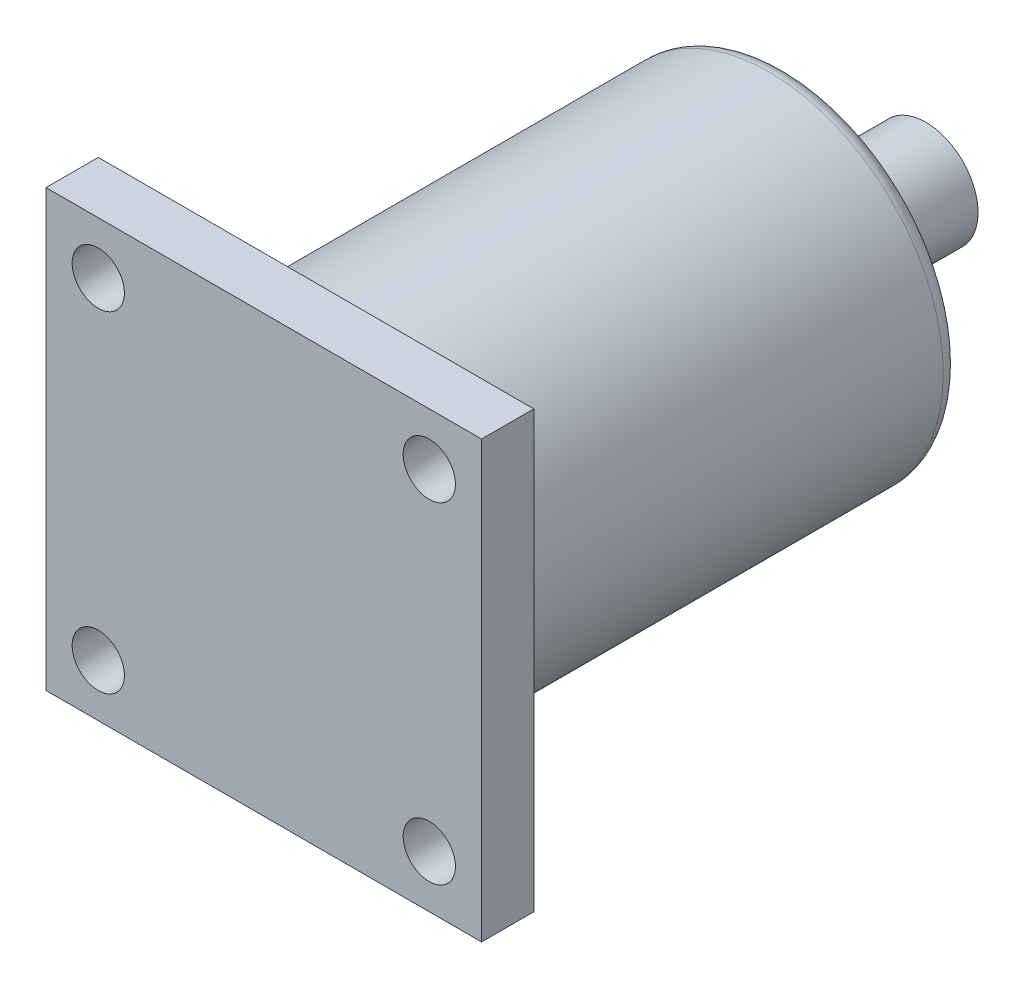
ISO-10303-21;
HEADER;
FILE_DESCRIPTION(('STEP AP214'),'2;1');
FILE_NAME('part.step','',(''),(''),'','','');
FILE_SCHEMA(('AUTOMOTIVE_DESIGN { 1 0 10303 214 1 1 1 1 }'));
ENDSEC;
DATA;
#1=APPLICATION_CONTEXT('core data for automotive mechanical design processes');
#2=APPLICATION_PROTOCOL_DEFINITION('international standard','automotive_design',2000,#1);
#3=PRODUCT_CONTEXT('',#1,'mechanical');
#4=PRODUCT('Part','Part','',(#3));
#5=PRODUCT_RELATED_PRODUCT_CATEGORY('part','',(#4));
#6=PRODUCT_DEFINITION_FORMATION('','',#4);
#7=PRODUCT_DEFINITION_CONTEXT('part definition',#1,'design');
#8=PRODUCT_DEFINITION('design','',#6,#7);
#9=PRODUCT_DEFINITION_SHAPE('','',#8);
#10=(LENGTH_UNIT() NAMED_UNIT(*) SI_UNIT(.MILLI.,.METRE.));
#11=(NAMED_UNIT(*) PLANE_ANGLE_UNIT() SI_UNIT($,.RADIAN.));
#12=(NAMED_UNIT(*) SI_UNIT($,.STERADIAN.) SOLID_ANGLE_UNIT());
#13=UNCERTAINTY_MEASURE_WITH_UNIT(LENGTH_MEASURE(1.E-05),#10,'distance_accuracy_value','');
#14=(GEOMETRIC_REPRESENTATION_CONTEXT(3) GLOBAL_UNCERTAINTY_ASSIGNED_CONTEXT((#13)) GLOBAL_UNIT_ASSIGNED_CONTEXT((#10,
#11,#12)) REPRESENTATION_CONTEXT('',''));
#15=CARTESIAN_POINT('',(0.,0.,0.));
#16=DIRECTION('',(0.,0.,1.));
#17=DIRECTION('',(1.,0.,0.));
#18=AXIS2_PLACEMENT_3D('',#15,#16,#17);
#19=CARTESIAN_POINT('',(0.,0.,3.));
#20=DIRECTION('',(1.,0.,0.));
#21=DIRECTION('',(0.,1.,0.));
#22=AXIS2_PLACEMENT_3D('',#19,#20,#21);
#23=PLANE('',#22);
#24=DIRECTION('',(0.,-1.,0.));
#25=VECTOR('',#24,1.);
#26=CARTESIAN_POINT('',(0.,0.,0.));
#27=LINE('',#26,#25);
#28=CARTESIAN_POINT('',(0.,0.,0.));
#29=VERTEX_POINT('',#28);
#30=CARTESIAN_POINT('',(0.,-25.,0.));
#31=VERTEX_POINT('',#30);
#32=EDGE_CURVE('E103',#29,#31,#27,.T.);
#33=ORIENTED_EDGE('',*,*,#32,.T.);
#34=DIRECTION('',(0.,0.,-1.));
#35=VECTOR('',#34,1.);
#36=CARTESIAN_POINT('',(0.,-25.,3.));
#37=LINE('',#36,#35);
#38=CARTESIAN_POINT('',(0.,-25.,3.));
#39=VERTEX_POINT('',#38);
#40=EDGE_CURVE('E94',#39,#31,#37,.T.);
#41=ORIENTED_EDGE('',*,*,#40,.F.);
#42=DIRECTION('',(0.,-1.,0.));
#43=VECTOR('',#42,1.);
#44=CARTESIAN_POINT('',(0.,0.,3.));
#45=LINE('',#44,#43);
#46=CARTESIAN_POINT('',(0.,0.,3.));
#47=VERTEX_POINT('',#46);
#48=EDGE_CURVE('E88',#47,#39,#45,.T.);
#49=ORIENTED_EDGE('',*,*,#48,.F.);
#50=DIRECTION('',(0.,0.,-1.));
#51=VECTOR('',#50,1.);
#52=CARTESIAN_POINT('',(0.,0.,3.));
#53=LINE('',#52,#51);
#54=EDGE_CURVE('E99',#47,#29,#53,.T.);
#55=ORIENTED_EDGE('',*,*,#54,.T.);
#56=EDGE_LOOP('',(#33,#41,#49,#55));
#57=FACE_BOUND('',#56,.T.);
#58=ADVANCED_FACE('F35',(#57),#23,.F.);
#59=CARTESIAN_POINT('',(0.,-25.,3.));
#60=DIRECTION('',(0.,1.,0.));
#61=DIRECTION('',(0.,0.,1.));
#62=AXIS2_PLACEMENT_3D('',#59,#60,#61);
#63=PLANE('',#62);
#64=DIRECTION('',(1.,0.,0.));
#65=VECTOR('',#64,1.);
#66=CARTESIAN_POINT('',(0.,-25.,0.));
#67=LINE('',#66,#65);
#68=CARTESIAN_POINT('',(25.,-25.,0.));
#69=VERTEX_POINT('',#68);
#70=EDGE_CURVE('E93',#31,#69,#67,.T.);
#71=ORIENTED_EDGE('',*,*,#70,.T.);
#72=DIRECTION('',(0.,0.,-1.));
#73=VECTOR('',#72,1.);
#74=CARTESIAN_POINT('',(25.,-25.,3.));
#75=LINE('',#74,#73);
#76=CARTESIAN_POINT('',(25.,-25.,3.));
#77=VERTEX_POINT('',#76);
#78=EDGE_CURVE('E91',#77,#69,#75,.T.);
#79=ORIENTED_EDGE('',*,*,#78,.F.);
#80=DIRECTION('',(1.,0.,0.));
#81=VECTOR('',#80,1.);
#82=CARTESIAN_POINT('',(0.,-25.,3.));
#83=LINE('',#82,#81);
#84=EDGE_CURVE('E83',#39,#77,#83,.T.);
#85=ORIENTED_EDGE('',*,*,#84,.F.);
#86=ORIENTED_EDGE('',*,*,#40,.T.);
#87=EDGE_LOOP('',(#71,#79,#85,#86));
#88=FACE_BOUND('',#87,.T.);
#89=ADVANCED_FACE('F92',(#88),#63,.F.);
#90=CARTESIAN_POINT('',(25.,0.,3.));
#91=DIRECTION('',(-1.,0.,0.));
#92=DIRECTION('',(0.,-1.,0.));
#93=AXIS2_PLACEMENT_3D('',#90,#91,#92);
#94=PLANE('',#93);
#95=DIRECTION('',(0.,1.,0.));
#96=VECTOR('',#95,1.);
#97=CARTESIAN_POINT('',(25.,0.,0.));
#98=LINE('',#97,#96);
#99=CARTESIAN_POINT('',(25.,0.,0.));
#100=VERTEX_POINT('',#99);
#101=EDGE_CURVE('E69',#69,#100,#98,.T.);
#102=ORIENTED_EDGE('',*,*,#101,.T.);
#103=DIRECTION('',(0.,0.,-1.));
#104=VECTOR('',#103,1.);
#105=CARTESIAN_POINT('',(25.,0.,3.));
#106=LINE('',#105,#104);
#107=CARTESIAN_POINT('',(25.,0.,3.));
#108=VERTEX_POINT('',#107);
#109=EDGE_CURVE('E95',#108,#100,#106,.T.);
#110=ORIENTED_EDGE('',*,*,#109,.F.);
#111=DIRECTION('',(0.,1.,0.));
#112=VECTOR('',#111,1.);
#113=CARTESIAN_POINT('',(25.,0.,3.));
#114=LINE('',#113,#112);
#115=EDGE_CURVE('E86',#77,#108,#114,.T.);
#116=ORIENTED_EDGE('',*,*,#115,.F.);
#117=ORIENTED_EDGE('',*,*,#78,.T.);
#118=EDGE_LOOP('',(#102,#110,#116,#117));
#119=FACE_BOUND('',#118,.T.);
#120=ADVANCED_FACE('F97',(#119),#94,.F.);
#121=CARTESIAN_POINT('',(0.,0.,3.));
#122=DIRECTION('',(0.,-1.,0.));
#123=DIRECTION('',(0.,0.,-1.));
#124=AXIS2_PLACEMENT_3D('',#121,#122,#123);
#125=PLANE('',#124);
#126=DIRECTION('',(-1.,0.,0.));
#127=VECTOR('',#126,1.);
#128=CARTESIAN_POINT('',(0.,0.,0.));
#129=LINE('',#128,#127);
#130=EDGE_CURVE('E75',#100,#29,#129,.T.);
#131=ORIENTED_EDGE('',*,*,#130,.T.);
#132=ORIENTED_EDGE('',*,*,#54,.F.);
#133=DIRECTION('',(-1.,0.,0.));
#134=VECTOR('',#133,1.);
#135=CARTESIAN_POINT('',(0.,0.,3.));
#136=LINE('',#135,#134);
#137=EDGE_CURVE('E52',#108,#47,#136,.T.);
#138=ORIENTED_EDGE('',*,*,#137,.F.);
#139=ORIENTED_EDGE('',*,*,#109,.T.);
#140=EDGE_LOOP('',(#131,#132,#138,#139));
#141=FACE_BOUND('',#140,.T.);
#142=ADVANCED_FACE('F165',(#141),#125,.F.);
#143=CARTESIAN_POINT('',(0.,0.,3.));
#144=DIRECTION('',(0.,0.,1.));
#145=DIRECTION('',(1.,0.,0.));
#146=AXIS2_PLACEMENT_3D('',#143,#144,#145);
#147=PLANE('',#146);
#148=CARTESIAN_POINT('',(22.,-22.,3.));
#149=DIRECTION('',(0.,0.,-1.));
#150=DIRECTION('',(1.,0.,0.));
#151=AXIS2_PLACEMENT_3D('',#148,#149,#150);
#152=CIRCLE('',#151,1.5);
#153=CARTESIAN_POINT('',(23.5,-22.,3.));
#154=VERTEX_POINT('',#153);
#155=EDGE_CURVE('E294',#154,#154,#152,.T.);
#156=ORIENTED_EDGE('',*,*,#155,.T.);
#157=EDGE_LOOP('',(#156));
#158=FACE_BOUND('',#157,.T.);
#159=CARTESIAN_POINT('',(3.,-22.,3.));
#160=DIRECTION('',(0.,0.,-1.));
#161=DIRECTION('',(-1.,0.,0.));
#162=AXIS2_PLACEMENT_3D('',#159,#160,#161);
#163=CIRCLE('',#162,1.5);
#164=CARTESIAN_POINT('',(1.49999999999999,-22.,3.));
#165=VERTEX_POINT('',#164);
#166=EDGE_CURVE('E303',#165,#165,#163,.T.);
#167=ORIENTED_EDGE('',*,*,#166,.T.);
#168=EDGE_LOOP('',(#167));
#169=FACE_BOUND('',#168,.T.);
#170=CARTESIAN_POINT('',(3.,-3.,3.));
#171=DIRECTION('',(0.,0.,-1.));
#172=DIRECTION('',(1.,0.,0.));
#173=AXIS2_PLACEMENT_3D('',#170,#171,#172);
#174=CIRCLE('',#173,1.5);
#175=CARTESIAN_POINT('',(4.5,-3.,3.));
#176=VERTEX_POINT('',#175);
#177=EDGE_CURVE('E299',#176,#176,#174,.T.);
#178=ORIENTED_EDGE('',*,*,#177,.T.);
#179=EDGE_LOOP('',(#178));
#180=FACE_BOUND('',#179,.T.);
#181=CARTESIAN_POINT('',(22.,-3.,3.));
#182=DIRECTION('',(0.,0.,-1.));
#183=DIRECTION('',(-1.,0.,0.));
#184=AXIS2_PLACEMENT_3D('',#181,#182,#183);
#185=CIRCLE('',#184,1.5);
#186=CARTESIAN_POINT('',(20.5,-3.,3.));
#187=VERTEX_POINT('',#186);
#188=EDGE_CURVE('E106',#187,#187,#185,.T.);
#189=ORIENTED_EDGE('',*,*,#188,.T.);
#190=EDGE_LOOP('',(#189));
#191=FACE_BOUND('',#190,.T.);
#192=ORIENTED_EDGE('',*,*,#48,.T.);
#193=ORIENTED_EDGE('',*,*,#84,.T.);
#194=ORIENTED_EDGE('',*,*,#115,.T.);
#195=ORIENTED_EDGE('',*,*,#137,.T.);
#196=EDGE_LOOP('',(#192,#193,#194,#195));
#197=FACE_BOUND('',#196,.T.);
#198=ADVANCED_FACE('F84',(#158,#169,#180,#191,#197),#147,.T.);
#199=CARTESIAN_POINT('',(0.,0.,0.));
#200=DIRECTION('',(0.,0.,1.));
#201=DIRECTION('',(1.,0.,0.));
#202=AXIS2_PLACEMENT_3D('',#199,#200,#201);
#203=PLANE('',#202);
#204=CARTESIAN_POINT('',(12.5,-12.5,0.));
#205=DIRECTION('',(0.,0.,1.));
#206=DIRECTION('',(1.,0.,0.));
#207=AXIS2_PLACEMENT_3D('',#204,#205,#206);
#208=CIRCLE('',#207,11.);
#209=CARTESIAN_POINT('',(23.5,-12.5,0.));
#210=VERTEX_POINT('',#209);
#211=EDGE_CURVE('E11',#210,#210,#208,.T.);
#212=ORIENTED_EDGE('',*,*,#211,.T.);
#213=EDGE_LOOP('',(#212));
#214=FACE_BOUND('',#213,.T.);
#215=CARTESIAN_POINT('',(22.,-22.,0.));
#216=DIRECTION('',(0.,0.,-1.));
#217=DIRECTION('',(1.,0.,0.));
#218=AXIS2_PLACEMENT_3D('',#215,#216,#217);
#219=CIRCLE('',#218,1.5);
#220=CARTESIAN_POINT('',(23.5,-22.,0.));
#221=VERTEX_POINT('',#220);
#222=EDGE_CURVE('E150',#221,#221,#219,.T.);
#223=ORIENTED_EDGE('',*,*,#222,.F.);
#224=EDGE_LOOP('',(#223));
#225=FACE_BOUND('',#224,.T.);
#226=CARTESIAN_POINT('',(3.,-22.,0.));
#227=DIRECTION('',(0.,0.,-1.));
#228=DIRECTION('',(-1.,0.,0.));
#229=AXIS2_PLACEMENT_3D('',#226,#227,#228);
#230=CIRCLE('',#229,1.5);
#231=CARTESIAN_POINT('',(1.49999999999999,-22.,0.));
#232=VERTEX_POINT('',#231);
#233=EDGE_CURVE('E154',#232,#232,#230,.T.);
#234=ORIENTED_EDGE('',*,*,#233,.F.);
#235=EDGE_LOOP('',(#234));
#236=FACE_BOUND('',#235,.T.);
#237=CARTESIAN_POINT('',(3.,-3.,0.));
#238=DIRECTION('',(0.,0.,-1.));
#239=DIRECTION('',(1.,0.,0.));
#240=AXIS2_PLACEMENT_3D('',#237,#238,#239);
#241=CIRCLE('',#240,1.5);
#242=CARTESIAN_POINT('',(4.5,-3.,0.));
#243=VERTEX_POINT('',#242);
#244=EDGE_CURVE('E158',#243,#243,#241,.T.);
#245=ORIENTED_EDGE('',*,*,#244,.F.);
#246=EDGE_LOOP('',(#245));
#247=FACE_BOUND('',#246,.T.);
#248=CARTESIAN_POINT('',(22.,-3.,0.));
#249=DIRECTION('',(0.,0.,-1.));
#250=DIRECTION('',(-1.,0.,0.));
#251=AXIS2_PLACEMENT_3D('',#248,#249,#250);
#252=CIRCLE('',#251,1.5);
#253=CARTESIAN_POINT('',(20.5,-3.,0.));
#254=VERTEX_POINT('',#253);
#255=EDGE_CURVE('E162',#254,#254,#252,.T.);
#256=ORIENTED_EDGE('',*,*,#255,.F.);
#257=EDGE_LOOP('',(#256));
#258=FACE_BOUND('',#257,.T.);
#259=ORIENTED_EDGE('',*,*,#32,.F.);
#260=ORIENTED_EDGE('',*,*,#130,.F.);
#261=ORIENTED_EDGE('',*,*,#101,.F.);
#262=ORIENTED_EDGE('',*,*,#70,.F.);
#263=EDGE_LOOP('',(#259,#260,#261,#262));
#264=FACE_BOUND('',#263,.T.);
#265=ADVANCED_FACE('F142',(#214,#225,#236,#247,#258,#264),#203,.F.);
#266=CARTESIAN_POINT('',(22.,-3.,3.));
#267=DIRECTION('',(0.,0.,-1.));
#268=DIRECTION('',(-1.,0.,0.));
#269=AXIS2_PLACEMENT_3D('',#266,#267,#268);
#270=CYLINDRICAL_SURFACE('',#269,1.5);
#271=ORIENTED_EDGE('',*,*,#188,.F.);
#272=EDGE_LOOP('',(#271));
#273=FACE_BOUND('',#272,.T.);
#274=ORIENTED_EDGE('',*,*,#255,.T.);
#275=EDGE_LOOP('',(#274));
#276=FACE_BOUND('',#275,.T.);
#277=ADVANCED_FACE('F145',(#273,#276),#270,.F.);
#278=CARTESIAN_POINT('',(3.,-3.,3.));
#279=DIRECTION('',(0.,0.,-1.));
#280=DIRECTION('',(-1.,0.,0.));
#281=AXIS2_PLACEMENT_3D('',#278,#279,#280);
#282=CYLINDRICAL_SURFACE('',#281,1.5);
#283=ORIENTED_EDGE('',*,*,#177,.F.);
#284=EDGE_LOOP('',(#283));
#285=FACE_BOUND('',#284,.T.);
#286=ORIENTED_EDGE('',*,*,#244,.T.);
#287=EDGE_LOOP('',(#286));
#288=FACE_BOUND('',#287,.T.);
#289=ADVANCED_FACE('F207',(#285,#288),#282,.F.);
#290=CARTESIAN_POINT('',(3.,-22.,3.));
#291=DIRECTION('',(0.,0.,-1.));
#292=DIRECTION('',(-1.,0.,0.));
#293=AXIS2_PLACEMENT_3D('',#290,#291,#292);
#294=CYLINDRICAL_SURFACE('',#293,1.5);
#295=ORIENTED_EDGE('',*,*,#166,.F.);
#296=EDGE_LOOP('',(#295));
#297=FACE_BOUND('',#296,.T.);
#298=ORIENTED_EDGE('',*,*,#233,.T.);
#299=EDGE_LOOP('',(#298));
#300=FACE_BOUND('',#299,.T.);
#301=ADVANCED_FACE('F217',(#297,#300),#294,.F.);
#302=CARTESIAN_POINT('',(22.,-22.,3.));
#303=DIRECTION('',(0.,0.,-1.));
#304=DIRECTION('',(-1.,0.,0.));
#305=AXIS2_PLACEMENT_3D('',#302,#303,#304);
#306=CYLINDRICAL_SURFACE('',#305,1.5);
#307=ORIENTED_EDGE('',*,*,#155,.F.);
#308=EDGE_LOOP('',(#307));
#309=FACE_BOUND('',#308,.T.);
#310=ORIENTED_EDGE('',*,*,#222,.T.);
#311=EDGE_LOOP('',(#310));
#312=FACE_BOUND('',#311,.T.);
#313=ADVANCED_FACE('F134',(#309,#312),#306,.F.);
#314=CARTESIAN_POINT('',(12.5,-12.5,-27.));
#315=DIRECTION('',(0.,0.,1.));
#316=DIRECTION('',(1.,0.,0.));
#317=AXIS2_PLACEMENT_3D('',#314,#315,#316);
#318=CYLINDRICAL_SURFACE('',#317,10.);
#319=CARTESIAN_POINT('',(12.5,-12.5,-26.));
#320=DIRECTION('',(0.,0.,1.));
#321=DIRECTION('',(1.,0.,0.));
#322=AXIS2_PLACEMENT_3D('',#319,#320,#321);
#323=CIRCLE('',#322,10.);
#324=CARTESIAN_POINT('',(22.5,-12.5,-26.));
#325=VERTEX_POINT('',#324);
#326=EDGE_CURVE('E117',#325,#325,#323,.T.);
#327=ORIENTED_EDGE('',*,*,#326,.T.);
#328=EDGE_LOOP('',(#327));
#329=FACE_BOUND('',#328,.T.);
#330=CARTESIAN_POINT('',(12.5,-12.5,-1.));
#331=DIRECTION('',(0.,0.,1.));
#332=DIRECTION('',(1.,0.,0.));
#333=AXIS2_PLACEMENT_3D('',#330,#331,#332);
#334=CIRCLE('',#333,10.);
#335=CARTESIAN_POINT('',(22.5,-12.5,-1.));
#336=VERTEX_POINT('',#335);
#337=EDGE_CURVE('E114',#336,#336,#334,.F.);
#338=ORIENTED_EDGE('',*,*,#337,.T.);
#339=EDGE_LOOP('',(#338));
#340=FACE_BOUND('',#339,.T.);
#341=ADVANCED_FACE('F131',(#329,#340),#318,.T.);
#342=CARTESIAN_POINT('',(12.5,-12.5,-27.));
#343=DIRECTION('',(0.,0.,1.));
#344=DIRECTION('',(1.,0.,0.));
#345=AXIS2_PLACEMENT_3D('',#342,#343,#344);
#346=PLANE('',#345);
#347=CARTESIAN_POINT('',(12.5,-12.5,-27.));
#348=DIRECTION('',(0.,0.,1.));
#349=DIRECTION('',(1.,0.,0.));
#350=AXIS2_PLACEMENT_3D('',#347,#348,#349);
#351=CIRCLE('',#350,9.);
#352=CARTESIAN_POINT('',(21.5,-12.5,-27.));
#353=VERTEX_POINT('',#352);
#354=EDGE_CURVE('E44',#353,#353,#351,.F.);
#355=ORIENTED_EDGE('',*,*,#354,.T.);
#356=EDGE_LOOP('',(#355));
#357=FACE_BOUND('',#356,.T.);
#358=CARTESIAN_POINT('',(12.5,-12.5,-27.));
#359=DIRECTION('',(0.,0.,-1.));
#360=DIRECTION('',(-1.,0.,0.));
#361=AXIS2_PLACEMENT_3D('',#358,#359,#360);
#362=CIRCLE('',#361,3.);
#363=CARTESIAN_POINT('',(9.5,-12.5,-27.));
#364=VERTEX_POINT('',#363);
#365=EDGE_CURVE('E113',#364,#364,#362,.T.);
#366=ORIENTED_EDGE('',*,*,#365,.F.);
#367=EDGE_LOOP('',(#366));
#368=FACE_BOUND('',#367,.T.);
#369=ADVANCED_FACE('F122',(#357,#368),#346,.F.);
#370=CARTESIAN_POINT('',(12.5,-12.5,-35.));
#371=DIRECTION('',(0.,0.,1.));
#372=DIRECTION('',(1.,0.,0.));
#373=AXIS2_PLACEMENT_3D('',#370,#371,#372);
#374=CYLINDRICAL_SURFACE('',#373,3.);
#375=CARTESIAN_POINT('',(12.5,-12.5,-35.));
#376=DIRECTION('',(0.,0.,-1.));
#377=DIRECTION('',(-1.,0.,0.));
#378=AXIS2_PLACEMENT_3D('',#375,#376,#377);
#379=CIRCLE('',#378,3.);
#380=CARTESIAN_POINT('',(9.5,-12.5,-35.));
#381=VERTEX_POINT('',#380);
#382=EDGE_CURVE('E292',#381,#381,#379,.T.);
#383=ORIENTED_EDGE('',*,*,#382,.F.);
#384=EDGE_LOOP('',(#383));
#385=FACE_BOUND('',#384,.T.);
#386=ORIENTED_EDGE('',*,*,#365,.T.);
#387=EDGE_LOOP('',(#386));
#388=FACE_BOUND('',#387,.T.);
#389=ADVANCED_FACE('F242',(#385,#388),#374,.T.);
#390=CARTESIAN_POINT('',(12.5,-12.5,-35.));
#391=DIRECTION('',(0.,0.,-1.));
#392=DIRECTION('',(-1.,0.,0.));
#393=AXIS2_PLACEMENT_3D('',#390,#391,#392);
#394=PLANE('',#393);
#395=ORIENTED_EDGE('',*,*,#382,.T.);
#396=EDGE_LOOP('',(#395));
#397=FACE_BOUND('',#396,.T.);
#398=ADVANCED_FACE('F128',(#397),#394,.T.);
#399=CARTESIAN_POINT('',(12.5,-12.5,-26.));
#400=DIRECTION('',(0.,0.,1.));
#401=DIRECTION('',(1.,0.,0.));
#402=AXIS2_PLACEMENT_3D('',#399,#400,#401);
#403=TOROIDAL_SURFACE('',#402,9.,1.);
#404=ORIENTED_EDGE('',*,*,#354,.F.);
#405=EDGE_LOOP('',(#404));
#406=FACE_BOUND('',#405,.T.);
#407=ORIENTED_EDGE('',*,*,#326,.F.);
#408=EDGE_LOOP('',(#407));
#409=FACE_BOUND('',#408,.T.);
#410=ADVANCED_FACE('F125',(#406,#409),#403,.T.);
#411=CARTESIAN_POINT('',(12.5,-12.5,-1.));
#412=DIRECTION('',(0.,0.,1.));
#413=DIRECTION('',(1.,0.,0.));
#414=AXIS2_PLACEMENT_3D('',#411,#412,#413);
#415=TOROIDAL_SURFACE('',#414,11.,1.);
#416=ORIENTED_EDGE('',*,*,#337,.F.);
#417=EDGE_LOOP('',(#416));
#418=FACE_BOUND('',#417,.T.);
#419=ORIENTED_EDGE('',*,*,#211,.F.);
#420=EDGE_LOOP('',(#419));
#421=FACE_BOUND('',#420,.T.);
#422=ADVANCED_FACE('F37',(#418,#421),#415,.F.);
#423=CLOSED_SHELL('',(#58,#89,#120,#142,#198,#265,#277,#289,#301,#313,#341,#369,#389,#398,#410,#422));
#424=MANIFOLD_SOLID_BREP('B2',#423);
#425=ADVANCED_BREP_SHAPE_REPRESENTATION('',(#18,#424),#14);
#426=SHAPE_DEFINITION_REPRESENTATION(#9,#425);
ENDSEC;
END-ISO-10303-21;
